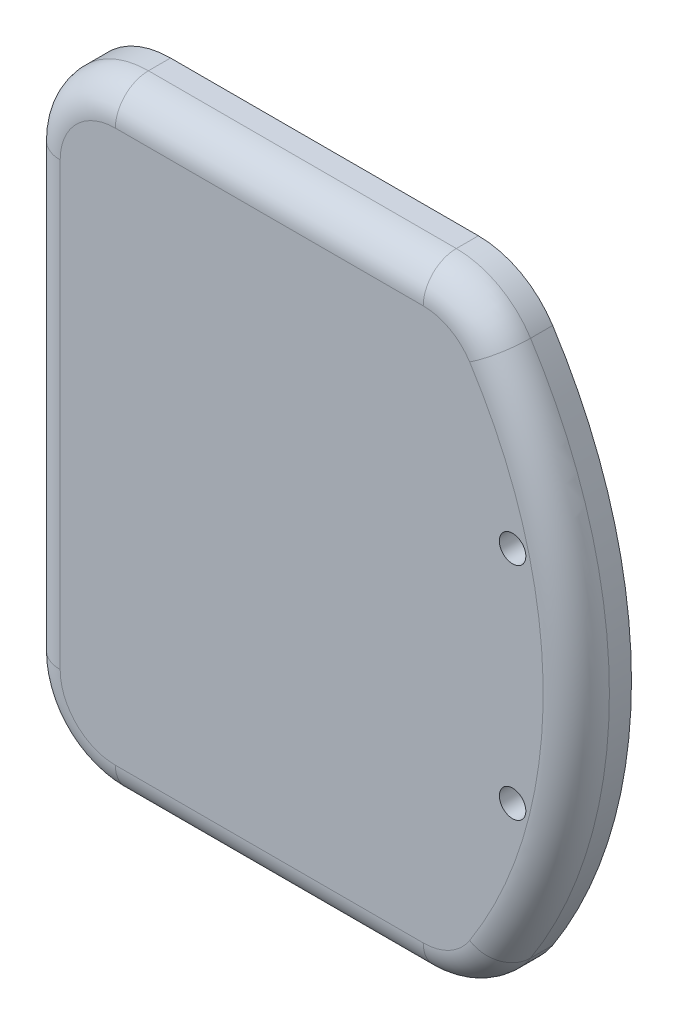
ISO-10303-21;
HEADER;
FILE_DESCRIPTION(('STEP AP214'),'2;1');
FILE_NAME('part.step','',(''),(''),'','','');
FILE_SCHEMA(('AUTOMOTIVE_DESIGN { 1 0 10303 214 1 1 1 1 }'));
ENDSEC;
DATA;
#1=APPLICATION_CONTEXT('core data for automotive mechanical design processes');
#2=APPLICATION_PROTOCOL_DEFINITION('international standard','automotive_design',2000,#1);
#3=PRODUCT_CONTEXT('',#1,'mechanical');
#4=PRODUCT('Part','Part','',(#3));
#5=PRODUCT_RELATED_PRODUCT_CATEGORY('part','',(#4));
#6=PRODUCT_DEFINITION_FORMATION('','',#4);
#7=PRODUCT_DEFINITION_CONTEXT('part definition',#1,'design');
#8=PRODUCT_DEFINITION('design','',#6,#7);
#9=PRODUCT_DEFINITION_SHAPE('','',#8);
#10=(LENGTH_UNIT() NAMED_UNIT(*) SI_UNIT(.MILLI.,.METRE.));
#11=(NAMED_UNIT(*) PLANE_ANGLE_UNIT() SI_UNIT($,.RADIAN.));
#12=(NAMED_UNIT(*) SI_UNIT($,.STERADIAN.) SOLID_ANGLE_UNIT());
#13=UNCERTAINTY_MEASURE_WITH_UNIT(LENGTH_MEASURE(1.E-05),#10,'distance_accuracy_value','');
#14=(GEOMETRIC_REPRESENTATION_CONTEXT(3) GLOBAL_UNCERTAINTY_ASSIGNED_CONTEXT((#13)) GLOBAL_UNIT_ASSIGNED_CONTEXT((#10,
#11,#12)) REPRESENTATION_CONTEXT('',''));
#15=CARTESIAN_POINT('',(0.,0.,0.));
#16=DIRECTION('',(0.,0.,1.));
#17=DIRECTION('',(1.,0.,0.));
#18=AXIS2_PLACEMENT_3D('',#15,#16,#17);
#19=CARTESIAN_POINT('',(0.,0.,-5.));
#20=DIRECTION('',(0.,-1.,0.));
#21=DIRECTION('',(0.,0.,-1.));
#22=AXIS2_PLACEMENT_3D('',#19,#20,#21);
#23=PLANE('',#22);
#24=DIRECTION('',(0.,0.,1.));
#25=VECTOR('',#24,1.);
#26=CARTESIAN_POINT('',(35.9009349249297,0.,-5.));
#27=LINE('',#26,#25);
#28=CARTESIAN_POINT('',(35.9009349249297,0.,-5.));
#29=VERTEX_POINT('',#28);
#30=CARTESIAN_POINT('',(35.9009349249297,0.,-3.));
#31=VERTEX_POINT('',#30);
#32=EDGE_CURVE('E158',#29,#31,#27,.T.);
#33=ORIENTED_EDGE('',*,*,#32,.T.);
#34=DIRECTION('',(1.,0.,0.));
#35=VECTOR('',#34,1.);
#36=CARTESIAN_POINT('',(0.,0.,-3.));
#37=LINE('',#36,#35);
#38=CARTESIAN_POINT('',(8.,0.,-3.));
#39=VERTEX_POINT('',#38);
#40=EDGE_CURVE('E193',#31,#39,#37,.F.);
#41=ORIENTED_EDGE('',*,*,#40,.T.);
#42=DIRECTION('',(0.,0.,1.));
#43=VECTOR('',#42,1.);
#44=CARTESIAN_POINT('',(8.,0.,-5.));
#45=LINE('',#44,#43);
#46=CARTESIAN_POINT('',(8.,0.,-5.));
#47=VERTEX_POINT('',#46);
#48=EDGE_CURVE('E161',#39,#47,#45,.F.);
#49=ORIENTED_EDGE('',*,*,#48,.T.);
#50=DIRECTION('',(1.,0.,0.));
#51=VECTOR('',#50,1.);
#52=CARTESIAN_POINT('',(0.,0.,-5.));
#53=LINE('',#52,#51);
#54=EDGE_CURVE('E153',#47,#29,#53,.T.);
#55=ORIENTED_EDGE('',*,*,#54,.T.);
#56=EDGE_LOOP('',(#33,#41,#49,#55));
#57=FACE_BOUND('',#56,.T.);
#58=ADVANCED_FACE('F41',(#57),#23,.T.);
#59=CARTESIAN_POINT('',(0.,0.,-5.));
#60=DIRECTION('',(1.,0.,0.));
#61=DIRECTION('',(0.,0.,-1.));
#62=AXIS2_PLACEMENT_3D('',#59,#60,#61);
#63=PLANE('',#62);
#64=DIRECTION('',(0.,0.,1.));
#65=VECTOR('',#64,1.);
#66=CARTESIAN_POINT('',(0.,8.,0.));
#67=LINE('',#66,#65);
#68=CARTESIAN_POINT('',(0.,8.,-5.));
#69=VERTEX_POINT('',#68);
#70=CARTESIAN_POINT('',(0.,8.,-3.));
#71=VERTEX_POINT('',#70);
#72=EDGE_CURVE('E171',#69,#71,#67,.T.);
#73=ORIENTED_EDGE('',*,*,#72,.T.);
#74=DIRECTION('',(0.,1.,0.));
#75=VECTOR('',#74,1.);
#76=CARTESIAN_POINT('',(0.,48.,-3.));
#77=LINE('',#76,#75);
#78=CARTESIAN_POINT('',(0.,48.,-3.));
#79=VERTEX_POINT('',#78);
#80=EDGE_CURVE('E197',#71,#79,#77,.T.);
#81=ORIENTED_EDGE('',*,*,#80,.T.);
#82=DIRECTION('',(0.,0.,1.));
#83=VECTOR('',#82,1.);
#84=CARTESIAN_POINT('',(0.,48.,-5.));
#85=LINE('',#84,#83);
#86=CARTESIAN_POINT('',(0.,48.,-5.));
#87=VERTEX_POINT('',#86);
#88=EDGE_CURVE('E169',#79,#87,#85,.F.);
#89=ORIENTED_EDGE('',*,*,#88,.T.);
#90=DIRECTION('',(0.,1.,0.));
#91=VECTOR('',#90,1.);
#92=CARTESIAN_POINT('',(0.,0.,-5.));
#93=LINE('',#92,#91);
#94=EDGE_CURVE('E142',#69,#87,#93,.T.);
#95=ORIENTED_EDGE('',*,*,#94,.F.);
#96=EDGE_LOOP('',(#73,#81,#89,#95));
#97=FACE_BOUND('',#96,.T.);
#98=ADVANCED_FACE('F285',(#97),#63,.F.);
#99=CARTESIAN_POINT('',(0.,56.,-5.));
#100=DIRECTION('',(0.,-1.,0.));
#101=DIRECTION('',(0.,0.,-1.));
#102=AXIS2_PLACEMENT_3D('',#99,#100,#101);
#103=PLANE('',#102);
#104=DIRECTION('',(0.,0.,1.));
#105=VECTOR('',#104,1.);
#106=CARTESIAN_POINT('',(8.,56.,-5.));
#107=LINE('',#106,#105);
#108=CARTESIAN_POINT('',(8.,56.,-5.));
#109=VERTEX_POINT('',#108);
#110=CARTESIAN_POINT('',(8.,56.,-3.));
#111=VERTEX_POINT('',#110);
#112=EDGE_CURVE('E238',#109,#111,#107,.T.);
#113=ORIENTED_EDGE('',*,*,#112,.T.);
#114=DIRECTION('',(1.,0.,0.));
#115=VECTOR('',#114,1.);
#116=CARTESIAN_POINT('',(35.9009349249297,56.,-3.));
#117=LINE('',#116,#115);
#118=CARTESIAN_POINT('',(35.9009349249297,56.,-3.));
#119=VERTEX_POINT('',#118);
#120=EDGE_CURVE('E65',#111,#119,#117,.T.);
#121=ORIENTED_EDGE('',*,*,#120,.T.);
#122=DIRECTION('',(0.,0.,-1.));
#123=VECTOR('',#122,1.);
#124=CARTESIAN_POINT('',(35.9009349249297,56.,-5.));
#125=LINE('',#124,#123);
#126=CARTESIAN_POINT('',(35.9009349249297,56.,-5.));
#127=VERTEX_POINT('',#126);
#128=EDGE_CURVE('E240',#119,#127,#125,.T.);
#129=ORIENTED_EDGE('',*,*,#128,.T.);
#130=DIRECTION('',(1.,0.,0.));
#131=VECTOR('',#130,1.);
#132=CARTESIAN_POINT('',(0.,56.,-5.));
#133=LINE('',#132,#131);
#134=EDGE_CURVE('E152',#109,#127,#133,.T.);
#135=ORIENTED_EDGE('',*,*,#134,.F.);
#136=EDGE_LOOP('',(#113,#121,#129,#135));
#137=FACE_BOUND('',#136,.T.);
#138=ADVANCED_FACE('F247',(#137),#103,.F.);
#139=CARTESIAN_POINT('',(4.77217009238293,28.,-5.));
#140=DIRECTION('',(0.,0.,1.));
#141=DIRECTION('',(1.,0.,0.));
#142=AXIS2_PLACEMENT_3D('',#139,#140,#141);
#143=CYLINDRICAL_SURFACE('',#142,45.);
#144=DIRECTION('',(0.,0.,1.));
#145=VECTOR('',#144,1.);
#146=CARTESIAN_POINT('',(42.6314786725074,52.3243243243243,-5.));
#147=LINE('',#146,#145);
#148=CARTESIAN_POINT('',(42.6314786725074,52.3243243243243,-5.));
#149=VERTEX_POINT('',#148);
#150=CARTESIAN_POINT('',(42.6314786725074,52.3243243243243,-3.));
#151=VERTEX_POINT('',#150);
#152=EDGE_CURVE('E141',#149,#151,#147,.T.);
#153=ORIENTED_EDGE('',*,*,#152,.T.);
#154=CARTESIAN_POINT('',(4.77217009238293,28.,-3.));
#155=DIRECTION('',(0.,0.,1.));
#156=DIRECTION('',(1.,0.,0.));
#157=AXIS2_PLACEMENT_3D('',#154,#155,#156);
#158=CIRCLE('',#157,45.);
#159=CARTESIAN_POINT('',(42.6314786725074,3.67567567567566,-3.));
#160=VERTEX_POINT('',#159);
#161=EDGE_CURVE('E11',#151,#160,#158,.F.);
#162=ORIENTED_EDGE('',*,*,#161,.T.);
#163=DIRECTION('',(0.,0.,1.));
#164=VECTOR('',#163,1.);
#165=CARTESIAN_POINT('',(42.6314786725074,3.67567567567566,-5.));
#166=LINE('',#165,#164);
#167=CARTESIAN_POINT('',(42.6314786725074,3.67567567567567,-5.));
#168=VERTEX_POINT('',#167);
#169=EDGE_CURVE('E132',#160,#168,#166,.F.);
#170=ORIENTED_EDGE('',*,*,#169,.T.);
#171=CARTESIAN_POINT('',(4.77217009238293,28.,-5.));
#172=DIRECTION('',(0.,0.,1.));
#173=DIRECTION('',(1.,0.,0.));
#174=AXIS2_PLACEMENT_3D('',#171,#172,#173);
#175=CIRCLE('',#174,45.);
#176=EDGE_CURVE('E135',#168,#149,#175,.T.);
#177=ORIENTED_EDGE('',*,*,#176,.T.);
#178=EDGE_LOOP('',(#153,#162,#170,#177));
#179=FACE_BOUND('',#178,.T.);
#180=ADVANCED_FACE('F134',(#179),#143,.T.);
#181=CARTESIAN_POINT('',(0.,0.,-5.));
#182=DIRECTION('',(0.,0.,1.));
#183=DIRECTION('',(1.,0.,0.));
#184=AXIS2_PLACEMENT_3D('',#181,#182,#183);
#185=PLANE('',#184);
#186=CARTESIAN_POINT('',(44.,38.,-5.));
#187=DIRECTION('',(0.,0.,1.));
#188=DIRECTION('',(1.,0.,0.));
#189=AXIS2_PLACEMENT_3D('',#186,#187,#188);
#190=CIRCLE('',#189,1.2);
#191=CARTESIAN_POINT('',(45.2000000000001,38.,-5.));
#192=VERTEX_POINT('',#191);
#193=EDGE_CURVE('E465',#192,#192,#190,.T.);
#194=ORIENTED_EDGE('',*,*,#193,.T.);
#195=EDGE_LOOP('',(#194));
#196=FACE_BOUND('',#195,.T.);
#197=CARTESIAN_POINT('',(44.,18.,-5.));
#198=DIRECTION('',(0.,0.,1.));
#199=DIRECTION('',(1.,0.,0.));
#200=AXIS2_PLACEMENT_3D('',#197,#198,#199);
#201=CIRCLE('',#200,1.2);
#202=CARTESIAN_POINT('',(45.2000000000001,18.,-5.));
#203=VERTEX_POINT('',#202);
#204=EDGE_CURVE('E206',#203,#203,#201,.T.);
#205=ORIENTED_EDGE('',*,*,#204,.T.);
#206=EDGE_LOOP('',(#205));
#207=FACE_BOUND('',#206,.T.);
#208=ORIENTED_EDGE('',*,*,#134,.T.);
#209=CARTESIAN_POINT('',(35.9009349249297,48.,-5.));
#210=DIRECTION('',(0.,0.,1.));
#211=DIRECTION('',(1.,0.,0.));
#212=AXIS2_PLACEMENT_3D('',#209,#210,#211);
#213=CIRCLE('',#212,8.);
#214=EDGE_CURVE('E151',#127,#149,#213,.F.);
#215=ORIENTED_EDGE('',*,*,#214,.T.);
#216=ORIENTED_EDGE('',*,*,#176,.F.);
#217=CARTESIAN_POINT('',(35.9009349249297,8.,-5.));
#218=DIRECTION('',(0.,0.,1.));
#219=DIRECTION('',(1.,0.,0.));
#220=AXIS2_PLACEMENT_3D('',#217,#218,#219);
#221=CIRCLE('',#220,8.);
#222=EDGE_CURVE('E148',#168,#29,#221,.F.);
#223=ORIENTED_EDGE('',*,*,#222,.T.);
#224=ORIENTED_EDGE('',*,*,#54,.F.);
#225=CARTESIAN_POINT('',(8.,8.,-5.));
#226=DIRECTION('',(0.,0.,1.));
#227=DIRECTION('',(1.,0.,0.));
#228=AXIS2_PLACEMENT_3D('',#225,#226,#227);
#229=CIRCLE('',#228,8.);
#230=EDGE_CURVE('E159',#47,#69,#229,.F.);
#231=ORIENTED_EDGE('',*,*,#230,.T.);
#232=ORIENTED_EDGE('',*,*,#94,.T.);
#233=CARTESIAN_POINT('',(8.,48.,-5.));
#234=DIRECTION('',(0.,0.,1.));
#235=DIRECTION('',(1.,0.,0.));
#236=AXIS2_PLACEMENT_3D('',#233,#234,#235);
#237=CIRCLE('',#236,8.);
#238=EDGE_CURVE('E163',#87,#109,#237,.F.);
#239=ORIENTED_EDGE('',*,*,#238,.T.);
#240=EDGE_LOOP('',(#208,#215,#216,#223,#224,#231,#232,#239));
#241=FACE_BOUND('',#240,.T.);
#242=ADVANCED_FACE('F146',(#196,#207,#241),#185,.F.);
#243=CARTESIAN_POINT('',(0.,0.,0.));
#244=DIRECTION('',(0.,0.,1.));
#245=DIRECTION('',(1.,0.,0.));
#246=AXIS2_PLACEMENT_3D('',#243,#244,#245);
#247=PLANE('',#246);
#248=CARTESIAN_POINT('',(44.,38.,0.));
#249=DIRECTION('',(0.,0.,1.));
#250=DIRECTION('',(1.,0.,0.));
#251=AXIS2_PLACEMENT_3D('',#248,#249,#250);
#252=CIRCLE('',#251,1.2);
#253=CARTESIAN_POINT('',(45.2000000000001,38.,0.));
#254=VERTEX_POINT('',#253);
#255=EDGE_CURVE('E462',#254,#254,#252,.T.);
#256=ORIENTED_EDGE('',*,*,#255,.F.);
#257=EDGE_LOOP('',(#256));
#258=FACE_BOUND('',#257,.T.);
#259=CARTESIAN_POINT('',(44.,18.,0.));
#260=DIRECTION('',(0.,0.,1.));
#261=DIRECTION('',(1.,0.,0.));
#262=AXIS2_PLACEMENT_3D('',#259,#260,#261);
#263=CIRCLE('',#262,1.2);
#264=CARTESIAN_POINT('',(45.2000000000001,18.,0.));
#265=VERTEX_POINT('',#264);
#266=EDGE_CURVE('E466',#265,#265,#263,.T.);
#267=ORIENTED_EDGE('',*,*,#266,.F.);
#268=EDGE_LOOP('',(#267));
#269=FACE_BOUND('',#268,.T.);
#270=DIRECTION('',(1.,0.,0.));
#271=VECTOR('',#270,1.);
#272=CARTESIAN_POINT('',(0.,3.,0.));
#273=LINE('',#272,#271);
#274=CARTESIAN_POINT('',(8.,3.,0.));
#275=VERTEX_POINT('',#274);
#276=CARTESIAN_POINT('',(35.9009349249297,3.,0.));
#277=VERTEX_POINT('',#276);
#278=EDGE_CURVE('E186',#275,#277,#273,.T.);
#279=ORIENTED_EDGE('',*,*,#278,.T.);
#280=CARTESIAN_POINT('',(35.9009349249297,8.,0.));
#281=DIRECTION('',(0.,0.,1.));
#282=DIRECTION('',(1.,0.,0.));
#283=AXIS2_PLACEMENT_3D('',#280,#281,#282);
#284=CIRCLE('',#283,5.);
#285=CARTESIAN_POINT('',(40.1075247671657,5.2972972972973,0.));
#286=VERTEX_POINT('',#285);
#287=EDGE_CURVE('E188',#277,#286,#284,.T.);
#288=ORIENTED_EDGE('',*,*,#287,.T.);
#289=CARTESIAN_POINT('',(4.77217009238293,28.,0.));
#290=DIRECTION('',(0.,0.,1.));
#291=DIRECTION('',(1.,0.,0.));
#292=AXIS2_PLACEMENT_3D('',#289,#290,#291);
#293=CIRCLE('',#292,42.);
#294=CARTESIAN_POINT('',(40.1075247671657,50.7027027027027,0.));
#295=VERTEX_POINT('',#294);
#296=EDGE_CURVE('E174',#286,#295,#293,.T.);
#297=ORIENTED_EDGE('',*,*,#296,.T.);
#298=CARTESIAN_POINT('',(35.9009349249297,48.,0.));
#299=DIRECTION('',(0.,0.,1.));
#300=DIRECTION('',(1.,0.,0.));
#301=AXIS2_PLACEMENT_3D('',#298,#299,#300);
#302=CIRCLE('',#301,5.);
#303=CARTESIAN_POINT('',(35.9009349249297,53.,0.));
#304=VERTEX_POINT('',#303);
#305=EDGE_CURVE('E176',#295,#304,#302,.T.);
#306=ORIENTED_EDGE('',*,*,#305,.T.);
#307=DIRECTION('',(1.,0.,0.));
#308=VECTOR('',#307,1.);
#309=CARTESIAN_POINT('',(8.,53.,0.));
#310=LINE('',#309,#308);
#311=CARTESIAN_POINT('',(8.,53.,0.));
#312=VERTEX_POINT('',#311);
#313=EDGE_CURVE('E178',#304,#312,#310,.F.);
#314=ORIENTED_EDGE('',*,*,#313,.T.);
#315=CARTESIAN_POINT('',(8.,48.,0.));
#316=DIRECTION('',(0.,0.,1.));
#317=DIRECTION('',(1.,0.,0.));
#318=AXIS2_PLACEMENT_3D('',#315,#316,#317);
#319=CIRCLE('',#318,5.);
#320=CARTESIAN_POINT('',(3.,48.,0.));
#321=VERTEX_POINT('',#320);
#322=EDGE_CURVE('E180',#312,#321,#319,.T.);
#323=ORIENTED_EDGE('',*,*,#322,.T.);
#324=DIRECTION('',(0.,1.,0.));
#325=VECTOR('',#324,1.);
#326=CARTESIAN_POINT('',(3.,8.,0.));
#327=LINE('',#326,#325);
#328=CARTESIAN_POINT('',(3.,8.,0.));
#329=VERTEX_POINT('',#328);
#330=EDGE_CURVE('E182',#321,#329,#327,.F.);
#331=ORIENTED_EDGE('',*,*,#330,.T.);
#332=CARTESIAN_POINT('',(8.,8.,0.));
#333=DIRECTION('',(0.,0.,1.));
#334=DIRECTION('',(1.,0.,0.));
#335=AXIS2_PLACEMENT_3D('',#332,#333,#334);
#336=CIRCLE('',#335,5.);
#337=EDGE_CURVE('E184',#329,#275,#336,.T.);
#338=ORIENTED_EDGE('',*,*,#337,.T.);
#339=EDGE_LOOP('',(#279,#288,#297,#306,#314,#323,#331,#338));
#340=FACE_BOUND('',#339,.T.);
#341=ADVANCED_FACE('F282',(#258,#269,#340),#247,.T.);
#342=CARTESIAN_POINT('',(35.9009349249297,48.,-5.));
#343=DIRECTION('',(0.,0.,1.));
#344=DIRECTION('',(1.,0.,0.));
#345=AXIS2_PLACEMENT_3D('',#342,#343,#344);
#346=CYLINDRICAL_SURFACE('',#345,8.);
#347=ORIENTED_EDGE('',*,*,#128,.F.);
#348=CARTESIAN_POINT('',(35.9009349249297,48.,-3.));
#349=DIRECTION('',(0.,0.,1.));
#350=DIRECTION('',(1.,0.,0.));
#351=AXIS2_PLACEMENT_3D('',#348,#349,#350);
#352=CIRCLE('',#351,8.);
#353=EDGE_CURVE('E50',#119,#151,#352,.F.);
#354=ORIENTED_EDGE('',*,*,#353,.T.);
#355=ORIENTED_EDGE('',*,*,#152,.F.);
#356=ORIENTED_EDGE('',*,*,#214,.F.);
#357=EDGE_LOOP('',(#347,#354,#355,#356));
#358=FACE_BOUND('',#357,.T.);
#359=ADVANCED_FACE('F299',(#358),#346,.T.);
#360=CARTESIAN_POINT('',(35.9009349249297,8.,-5.));
#361=DIRECTION('',(0.,0.,1.));
#362=DIRECTION('',(1.,0.,0.));
#363=AXIS2_PLACEMENT_3D('',#360,#361,#362);
#364=CYLINDRICAL_SURFACE('',#363,8.);
#365=ORIENTED_EDGE('',*,*,#169,.F.);
#366=CARTESIAN_POINT('',(35.9009349249297,8.,-3.));
#367=DIRECTION('',(0.,0.,1.));
#368=DIRECTION('',(1.,0.,0.));
#369=AXIS2_PLACEMENT_3D('',#366,#367,#368);
#370=CIRCLE('',#369,8.);
#371=EDGE_CURVE('E191',#160,#31,#370,.F.);
#372=ORIENTED_EDGE('',*,*,#371,.T.);
#373=ORIENTED_EDGE('',*,*,#32,.F.);
#374=ORIENTED_EDGE('',*,*,#222,.F.);
#375=EDGE_LOOP('',(#365,#372,#373,#374));
#376=FACE_BOUND('',#375,.T.);
#377=ADVANCED_FACE('F156',(#376),#364,.T.);
#378=CARTESIAN_POINT('',(8.,8.,-5.));
#379=DIRECTION('',(0.,0.,-1.));
#380=DIRECTION('',(-1.,0.,0.));
#381=AXIS2_PLACEMENT_3D('',#378,#379,#380);
#382=CYLINDRICAL_SURFACE('',#381,8.);
#383=ORIENTED_EDGE('',*,*,#48,.F.);
#384=CARTESIAN_POINT('',(8.,8.,-3.));
#385=DIRECTION('',(0.,0.,1.));
#386=DIRECTION('',(1.,0.,0.));
#387=AXIS2_PLACEMENT_3D('',#384,#385,#386);
#388=CIRCLE('',#387,8.);
#389=EDGE_CURVE('E195',#39,#71,#388,.F.);
#390=ORIENTED_EDGE('',*,*,#389,.T.);
#391=ORIENTED_EDGE('',*,*,#72,.F.);
#392=ORIENTED_EDGE('',*,*,#230,.F.);
#393=EDGE_LOOP('',(#383,#390,#391,#392));
#394=FACE_BOUND('',#393,.T.);
#395=ADVANCED_FACE('F272',(#394),#382,.T.);
#396=CARTESIAN_POINT('',(8.,48.,-5.));
#397=DIRECTION('',(0.,0.,1.));
#398=DIRECTION('',(1.,0.,0.));
#399=AXIS2_PLACEMENT_3D('',#396,#397,#398);
#400=CYLINDRICAL_SURFACE('',#399,8.);
#401=ORIENTED_EDGE('',*,*,#88,.F.);
#402=CARTESIAN_POINT('',(8.,48.,-3.));
#403=DIRECTION('',(0.,0.,1.));
#404=DIRECTION('',(1.,0.,0.));
#405=AXIS2_PLACEMENT_3D('',#402,#403,#404);
#406=CIRCLE('',#405,8.);
#407=EDGE_CURVE('E199',#79,#111,#406,.F.);
#408=ORIENTED_EDGE('',*,*,#407,.T.);
#409=ORIENTED_EDGE('',*,*,#112,.F.);
#410=ORIENTED_EDGE('',*,*,#238,.F.);
#411=EDGE_LOOP('',(#401,#408,#409,#410));
#412=FACE_BOUND('',#411,.T.);
#413=ADVANCED_FACE('F248',(#412),#400,.T.);
#414=CARTESIAN_POINT('',(8.,48.,-3.));
#415=DIRECTION('',(0.,0.,1.));
#416=DIRECTION('',(1.,0.,0.));
#417=AXIS2_PLACEMENT_3D('',#414,#415,#416);
#418=TOROIDAL_SURFACE('',#417,5.,3.);
#419=CARTESIAN_POINT('',(8.,53.,-3.));
#420=DIRECTION('',(1.,0.,0.));
#421=DIRECTION('',(0.,0.,-1.));
#422=AXIS2_PLACEMENT_3D('',#419,#420,#421);
#423=CIRCLE('',#422,3.);
#424=EDGE_CURVE('E219',#111,#312,#423,.T.);
#425=ORIENTED_EDGE('',*,*,#424,.F.);
#426=ORIENTED_EDGE('',*,*,#407,.F.);
#427=CARTESIAN_POINT('',(3.,48.,-3.));
#428=DIRECTION('',(0.,-1.,0.));
#429=DIRECTION('',(0.,0.,-1.));
#430=AXIS2_PLACEMENT_3D('',#427,#428,#429);
#431=CIRCLE('',#430,3.);
#432=EDGE_CURVE('E45',#321,#79,#431,.T.);
#433=ORIENTED_EDGE('',*,*,#432,.F.);
#434=ORIENTED_EDGE('',*,*,#322,.F.);
#435=EDGE_LOOP('',(#425,#426,#433,#434));
#436=FACE_BOUND('',#435,.T.);
#437=ADVANCED_FACE('F43',(#436),#418,.T.);
#438=CARTESIAN_POINT('',(3.,0.,-3.));
#439=DIRECTION('',(0.,-1.,0.));
#440=DIRECTION('',(0.,0.,-1.));
#441=AXIS2_PLACEMENT_3D('',#438,#439,#440);
#442=CYLINDRICAL_SURFACE('',#441,3.);
#443=ORIENTED_EDGE('',*,*,#432,.T.);
#444=ORIENTED_EDGE('',*,*,#80,.F.);
#445=CARTESIAN_POINT('',(3.,8.,-3.));
#446=DIRECTION('',(0.,-1.,0.));
#447=DIRECTION('',(0.,0.,-1.));
#448=AXIS2_PLACEMENT_3D('',#445,#446,#447);
#449=CIRCLE('',#448,3.);
#450=EDGE_CURVE('E217',#329,#71,#449,.T.);
#451=ORIENTED_EDGE('',*,*,#450,.F.);
#452=ORIENTED_EDGE('',*,*,#330,.F.);
#453=EDGE_LOOP('',(#443,#444,#451,#452));
#454=FACE_BOUND('',#453,.T.);
#455=ADVANCED_FACE('F283',(#454),#442,.T.);
#456=CARTESIAN_POINT('',(0.,53.,-3.));
#457=DIRECTION('',(-1.,0.,0.));
#458=DIRECTION('',(0.,0.,1.));
#459=AXIS2_PLACEMENT_3D('',#456,#457,#458);
#460=CYLINDRICAL_SURFACE('',#459,3.);
#461=ORIENTED_EDGE('',*,*,#424,.T.);
#462=ORIENTED_EDGE('',*,*,#313,.F.);
#463=CARTESIAN_POINT('',(35.9009349249297,53.,-3.));
#464=DIRECTION('',(1.,0.,0.));
#465=DIRECTION('',(0.,0.,-1.));
#466=AXIS2_PLACEMENT_3D('',#463,#464,#465);
#467=CIRCLE('',#466,3.);
#468=EDGE_CURVE('E214',#119,#304,#467,.T.);
#469=ORIENTED_EDGE('',*,*,#468,.F.);
#470=ORIENTED_EDGE('',*,*,#120,.F.);
#471=EDGE_LOOP('',(#461,#462,#469,#470));
#472=FACE_BOUND('',#471,.T.);
#473=ADVANCED_FACE('F253',(#472),#460,.T.);
#474=CARTESIAN_POINT('',(8.,8.,-3.));
#475=DIRECTION('',(0.,0.,1.));
#476=DIRECTION('',(1.,0.,0.));
#477=AXIS2_PLACEMENT_3D('',#474,#475,#476);
#478=TOROIDAL_SURFACE('',#477,5.,3.);
#479=ORIENTED_EDGE('',*,*,#450,.T.);
#480=ORIENTED_EDGE('',*,*,#389,.F.);
#481=CARTESIAN_POINT('',(8.,3.,-3.));
#482=DIRECTION('',(1.,0.,0.));
#483=DIRECTION('',(0.,0.,-1.));
#484=AXIS2_PLACEMENT_3D('',#481,#482,#483);
#485=CIRCLE('',#484,3.);
#486=EDGE_CURVE('E211',#275,#39,#485,.T.);
#487=ORIENTED_EDGE('',*,*,#486,.F.);
#488=ORIENTED_EDGE('',*,*,#337,.F.);
#489=EDGE_LOOP('',(#479,#480,#487,#488));
#490=FACE_BOUND('',#489,.T.);
#491=ADVANCED_FACE('F276',(#490),#478,.T.);
#492=CARTESIAN_POINT('',(35.9009349249297,48.,-3.));
#493=DIRECTION('',(0.,0.,1.));
#494=DIRECTION('',(1.,0.,0.));
#495=AXIS2_PLACEMENT_3D('',#492,#493,#494);
#496=TOROIDAL_SURFACE('',#495,5.,3.);
#497=ORIENTED_EDGE('',*,*,#468,.T.);
#498=ORIENTED_EDGE('',*,*,#305,.F.);
#499=CARTESIAN_POINT('',(40.1075247671657,50.7027027027027,-3.));
#500=DIRECTION('',(0.540540540540541,-0.841317968447209,0.));
#501=DIRECTION('',(0.841317968447209,0.540540540540541,0.));
#502=AXIS2_PLACEMENT_3D('',#499,#500,#501);
#503=CIRCLE('',#502,3.);
#504=EDGE_CURVE('E208',#151,#295,#503,.T.);
#505=ORIENTED_EDGE('',*,*,#504,.F.);
#506=ORIENTED_EDGE('',*,*,#353,.F.);
#507=EDGE_LOOP('',(#497,#498,#505,#506));
#508=FACE_BOUND('',#507,.T.);
#509=ADVANCED_FACE('F257',(#508),#496,.T.);
#510=CARTESIAN_POINT('',(0.,3.,-3.));
#511=DIRECTION('',(1.,0.,0.));
#512=DIRECTION('',(0.,0.,-1.));
#513=AXIS2_PLACEMENT_3D('',#510,#511,#512);
#514=CYLINDRICAL_SURFACE('',#513,3.);
#515=ORIENTED_EDGE('',*,*,#486,.T.);
#516=ORIENTED_EDGE('',*,*,#40,.F.);
#517=CARTESIAN_POINT('',(35.9009349249297,3.,-3.));
#518=DIRECTION('',(1.,0.,0.));
#519=DIRECTION('',(0.,0.,-1.));
#520=AXIS2_PLACEMENT_3D('',#517,#518,#519);
#521=CIRCLE('',#520,3.);
#522=EDGE_CURVE('E205',#277,#31,#521,.T.);
#523=ORIENTED_EDGE('',*,*,#522,.F.);
#524=ORIENTED_EDGE('',*,*,#278,.F.);
#525=EDGE_LOOP('',(#515,#516,#523,#524));
#526=FACE_BOUND('',#525,.T.);
#527=ADVANCED_FACE('F280',(#526),#514,.T.);
#528=CARTESIAN_POINT('',(4.77217009238293,28.,-3.));
#529=DIRECTION('',(0.,0.,1.));
#530=DIRECTION('',(1.,0.,0.));
#531=AXIS2_PLACEMENT_3D('',#528,#529,#530);
#532=TOROIDAL_SURFACE('',#531,42.,3.);
#533=ORIENTED_EDGE('',*,*,#504,.T.);
#534=ORIENTED_EDGE('',*,*,#296,.F.);
#535=CARTESIAN_POINT('',(40.1075247671657,5.29729729729729,-3.));
#536=DIRECTION('',(-0.540540540540541,-0.84131796844721,0.));
#537=DIRECTION('',(0.84131796844721,-0.540540540540541,0.));
#538=AXIS2_PLACEMENT_3D('',#535,#536,#537);
#539=CIRCLE('',#538,3.);
#540=EDGE_CURVE('E203',#160,#286,#539,.T.);
#541=ORIENTED_EDGE('',*,*,#540,.F.);
#542=ORIENTED_EDGE('',*,*,#161,.F.);
#543=EDGE_LOOP('',(#533,#534,#541,#542));
#544=FACE_BOUND('',#543,.T.);
#545=ADVANCED_FACE('F261',(#544),#532,.T.);
#546=CARTESIAN_POINT('',(35.9009349249297,8.,-3.));
#547=DIRECTION('',(0.,0.,1.));
#548=DIRECTION('',(1.,0.,0.));
#549=AXIS2_PLACEMENT_3D('',#546,#547,#548);
#550=TOROIDAL_SURFACE('',#549,5.,3.);
#551=ORIENTED_EDGE('',*,*,#522,.T.);
#552=ORIENTED_EDGE('',*,*,#371,.F.);
#553=ORIENTED_EDGE('',*,*,#540,.T.);
#554=ORIENTED_EDGE('',*,*,#287,.F.);
#555=EDGE_LOOP('',(#551,#552,#553,#554));
#556=FACE_BOUND('',#555,.T.);
#557=ADVANCED_FACE('F264',(#556),#550,.T.);
#558=CARTESIAN_POINT('',(44.,18.,0.));
#559=DIRECTION('',(0.,0.,1.));
#560=DIRECTION('',(1.,0.,0.));
#561=AXIS2_PLACEMENT_3D('',#558,#559,#560);
#562=CYLINDRICAL_SURFACE('',#561,1.2);
#563=ORIENTED_EDGE('',*,*,#266,.T.);
#564=EDGE_LOOP('',(#563));
#565=FACE_BOUND('',#564,.T.);
#566=ORIENTED_EDGE('',*,*,#204,.F.);
#567=EDGE_LOOP('',(#566));
#568=FACE_BOUND('',#567,.T.);
#569=ADVANCED_FACE('F310',(#565,#568),#562,.F.);
#570=CARTESIAN_POINT('',(44.,38.,0.));
#571=DIRECTION('',(0.,0.,1.));
#572=DIRECTION('',(1.,0.,0.));
#573=AXIS2_PLACEMENT_3D('',#570,#571,#572);
#574=CYLINDRICAL_SURFACE('',#573,1.2);
#575=ORIENTED_EDGE('',*,*,#255,.T.);
#576=EDGE_LOOP('',(#575));
#577=FACE_BOUND('',#576,.T.);
#578=ORIENTED_EDGE('',*,*,#193,.F.);
#579=EDGE_LOOP('',(#578));
#580=FACE_BOUND('',#579,.T.);
#581=ADVANCED_FACE('F440',(#577,#580),#574,.F.);
#582=CLOSED_SHELL('',(#58,#98,#138,#180,#242,#341,#359,#377,#395,#413,#437,#455,#473,#491,#509,
#527,#545,#557,#569,#581));
#583=MANIFOLD_SOLID_BREP('B2',#582);
#584=ADVANCED_BREP_SHAPE_REPRESENTATION('',(#18,#583),#14);
#585=SHAPE_DEFINITION_REPRESENTATION(#9,#584);
ENDSEC;
END-ISO-10303-21;
